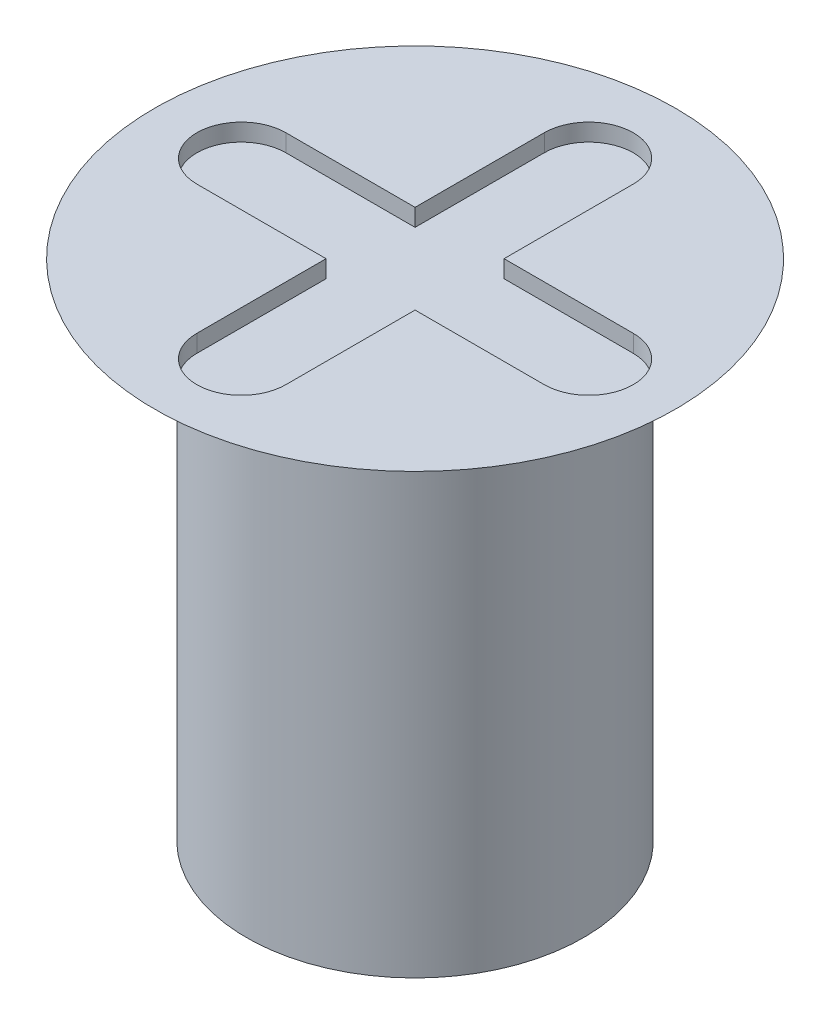
ISO-10303-21;
HEADER;
FILE_DESCRIPTION(('STEP AP214'),'2;1');
FILE_NAME('part.step','',(''),(''),'','','');
FILE_SCHEMA(('AUTOMOTIVE_DESIGN { 1 0 10303 214 1 1 1 1 }'));
ENDSEC;
DATA;
#1=APPLICATION_CONTEXT('core data for automotive mechanical design processes');
#2=APPLICATION_PROTOCOL_DEFINITION('international standard','automotive_design',2000,#1);
#3=PRODUCT_CONTEXT('',#1,'mechanical');
#4=PRODUCT('Part','Part','',(#3));
#5=PRODUCT_RELATED_PRODUCT_CATEGORY('part','',(#4));
#6=PRODUCT_DEFINITION_FORMATION('','',#4);
#7=PRODUCT_DEFINITION_CONTEXT('part definition',#1,'design');
#8=PRODUCT_DEFINITION('design','',#6,#7);
#9=PRODUCT_DEFINITION_SHAPE('','',#8);
#10=(LENGTH_UNIT() NAMED_UNIT(*) SI_UNIT(.MILLI.,.METRE.));
#11=(NAMED_UNIT(*) PLANE_ANGLE_UNIT() SI_UNIT($,.RADIAN.));
#12=(NAMED_UNIT(*) SI_UNIT($,.STERADIAN.) SOLID_ANGLE_UNIT());
#13=UNCERTAINTY_MEASURE_WITH_UNIT(LENGTH_MEASURE(1.E-05),#10,'distance_accuracy_value','');
#14=(GEOMETRIC_REPRESENTATION_CONTEXT(3) GLOBAL_UNCERTAINTY_ASSIGNED_CONTEXT((#13)) GLOBAL_UNIT_ASSIGNED_CONTEXT((#10,
#11,#12)) REPRESENTATION_CONTEXT('',''));
#15=CARTESIAN_POINT('',(0.,0.,0.));
#16=DIRECTION('',(0.,0.,1.));
#17=DIRECTION('',(1.,0.,0.));
#18=AXIS2_PLACEMENT_3D('',#15,#16,#17);
#19=CARTESIAN_POINT('',(0.,2.9,0.));
#20=DIRECTION('',(0.,1.,0.));
#21=DIRECTION('',(0.,0.,1.));
#22=AXIS2_PLACEMENT_3D('',#19,#20,#21);
#23=PLANE('',#22);
#24=CARTESIAN_POINT('',(0.,2.9,-1.));
#25=DIRECTION('',(0.,1.,0.));
#26=DIRECTION('',(0.,0.,1.));
#27=AXIS2_PLACEMENT_3D('',#24,#25,#26);
#28=CIRCLE('',#27,0.256120786291816);
#29=CARTESIAN_POINT('',(0.256120786291816,2.9,-1.));
#30=VERTEX_POINT('',#29);
#31=CARTESIAN_POINT('',(-0.256120786291816,2.9,-1.));
#32=VERTEX_POINT('',#31);
#33=EDGE_CURVE('E46',#30,#32,#28,.T.);
#34=ORIENTED_EDGE('',*,*,#33,.F.);
#35=DIRECTION('',(0.,0.,-1.));
#36=VECTOR('',#35,1.);
#37=CARTESIAN_POINT('',(0.256120786291816,2.9,-1.));
#38=LINE('',#37,#36);
#39=CARTESIAN_POINT('',(0.256120786291816,2.9,-0.256120786291816));
#40=VERTEX_POINT('',#39);
#41=EDGE_CURVE('E183',#40,#30,#38,.T.);
#42=ORIENTED_EDGE('',*,*,#41,.F.);
#43=DIRECTION('',(-1.,0.,0.));
#44=VECTOR('',#43,1.);
#45=CARTESIAN_POINT('',(0.256120786291816,2.9,-0.256120786291816));
#46=LINE('',#45,#44);
#47=CARTESIAN_POINT('',(1.,2.9,-0.256120786291815));
#48=VERTEX_POINT('',#47);
#49=EDGE_CURVE('E181',#48,#40,#46,.T.);
#50=ORIENTED_EDGE('',*,*,#49,.F.);
#51=CARTESIAN_POINT('',(1.,2.9,0.));
#52=DIRECTION('',(0.,1.,0.));
#53=DIRECTION('',(0.,0.,1.));
#54=AXIS2_PLACEMENT_3D('',#51,#52,#53);
#55=CIRCLE('',#54,0.256120786291816);
#56=CARTESIAN_POINT('',(1.,2.9,0.256120786291816));
#57=VERTEX_POINT('',#56);
#58=EDGE_CURVE('E130',#57,#48,#55,.T.);
#59=ORIENTED_EDGE('',*,*,#58,.F.);
#60=DIRECTION('',(1.,0.,0.));
#61=VECTOR('',#60,1.);
#62=CARTESIAN_POINT('',(0.256120786291816,2.9,0.256120786291816));
#63=LINE('',#62,#61);
#64=CARTESIAN_POINT('',(0.256120786291816,2.9,0.256120786291816));
#65=VERTEX_POINT('',#64);
#66=EDGE_CURVE('E177',#65,#57,#63,.T.);
#67=ORIENTED_EDGE('',*,*,#66,.F.);
#68=DIRECTION('',(0.,0.,-1.));
#69=VECTOR('',#68,1.);
#70=CARTESIAN_POINT('',(0.256120786291816,2.9,0.256120786291816));
#71=LINE('',#70,#69);
#72=CARTESIAN_POINT('',(0.256120786291816,2.9,1.));
#73=VERTEX_POINT('',#72);
#74=EDGE_CURVE('E174',#73,#65,#71,.T.);
#75=ORIENTED_EDGE('',*,*,#74,.F.);
#76=CARTESIAN_POINT('',(0.,2.9,1.));
#77=DIRECTION('',(0.,1.,0.));
#78=DIRECTION('',(0.,0.,1.));
#79=AXIS2_PLACEMENT_3D('',#76,#77,#78);
#80=CIRCLE('',#79,0.256120786291816);
#81=CARTESIAN_POINT('',(-0.256120786291816,2.9,1.));
#82=VERTEX_POINT('',#81);
#83=EDGE_CURVE('E171',#82,#73,#80,.T.);
#84=ORIENTED_EDGE('',*,*,#83,.F.);
#85=DIRECTION('',(0.,0.,1.));
#86=VECTOR('',#85,1.);
#87=CARTESIAN_POINT('',(-0.256120786291816,2.9,0.256120786291816));
#88=LINE('',#87,#86);
#89=CARTESIAN_POINT('',(-0.256120786291816,2.9,0.256120786291816));
#90=VERTEX_POINT('',#89);
#91=EDGE_CURVE('E168',#90,#82,#88,.T.);
#92=ORIENTED_EDGE('',*,*,#91,.F.);
#93=DIRECTION('',(1.,0.,0.));
#94=VECTOR('',#93,1.);
#95=CARTESIAN_POINT('',(-1.,2.9,0.256120786291816));
#96=LINE('',#95,#94);
#97=CARTESIAN_POINT('',(-1.,2.9,0.256120786291816));
#98=VERTEX_POINT('',#97);
#99=EDGE_CURVE('E165',#98,#90,#96,.T.);
#100=ORIENTED_EDGE('',*,*,#99,.F.);
#101=CARTESIAN_POINT('',(-1.,2.9,0.));
#102=DIRECTION('',(0.,1.,0.));
#103=DIRECTION('',(0.,0.,1.));
#104=AXIS2_PLACEMENT_3D('',#101,#102,#103);
#105=CIRCLE('',#104,0.256120786291816);
#106=CARTESIAN_POINT('',(-1.,2.9,-0.256120786291816));
#107=VERTEX_POINT('',#106);
#108=EDGE_CURVE('E162',#107,#98,#105,.T.);
#109=ORIENTED_EDGE('',*,*,#108,.F.);
#110=DIRECTION('',(-1.,0.,0.));
#111=VECTOR('',#110,1.);
#112=CARTESIAN_POINT('',(-1.,2.9,-0.256120786291816));
#113=LINE('',#112,#111);
#114=CARTESIAN_POINT('',(-0.256120786291816,2.9,-0.256120786291816));
#115=VERTEX_POINT('',#114);
#116=EDGE_CURVE('E159',#115,#107,#113,.T.);
#117=ORIENTED_EDGE('',*,*,#116,.F.);
#118=DIRECTION('',(0.,0.,1.));
#119=VECTOR('',#118,1.);
#120=CARTESIAN_POINT('',(-0.256120786291816,2.9,-1.));
#121=LINE('',#120,#119);
#122=EDGE_CURVE('E156',#32,#115,#121,.T.);
#123=ORIENTED_EDGE('',*,*,#122,.F.);
#124=EDGE_LOOP('',(#34,#42,#50,#59,#67,#75,#84,#92,#100,#109,#117,#123));
#125=FACE_BOUND('',#124,.T.);
#126=CARTESIAN_POINT('',(0.,2.9,0.));
#127=DIRECTION('',(0.,-1.,0.));
#128=DIRECTION('',(0.,0.,-1.));
#129=AXIS2_PLACEMENT_3D('',#126,#127,#128);
#130=CIRCLE('',#129,1.5);
#131=CARTESIAN_POINT('',(0.,2.9,-1.5));
#132=VERTEX_POINT('',#131);
#133=EDGE_CURVE('E11',#132,#132,#130,.T.);
#134=ORIENTED_EDGE('',*,*,#133,.F.);
#135=EDGE_LOOP('',(#134));
#136=FACE_BOUND('',#135,.T.);
#137=ADVANCED_FACE('F32',(#125,#136),#23,.T.);
#138=CARTESIAN_POINT('',(0.,2.59400435732949,0.));
#139=DIRECTION('',(0.,1.,0.));
#140=DIRECTION('',(0.,0.,1.));
#141=AXIS2_PLACEMENT_3D('',#138,#139,#140);
#142=CONICAL_SURFACE('',#141,0.97,1.04719755119659);
#143=ORIENTED_EDGE('',*,*,#133,.T.);
#144=EDGE_LOOP('',(#143));
#145=FACE_BOUND('',#144,.T.);
#146=CARTESIAN_POINT('',(0.,2.59400435732949,0.));
#147=DIRECTION('',(0.,-1.,0.));
#148=DIRECTION('',(0.,0.,-1.));
#149=AXIS2_PLACEMENT_3D('',#146,#147,#148);
#150=CIRCLE('',#149,0.97);
#151=CARTESIAN_POINT('',(0.,2.59400435732949,-0.97));
#152=VERTEX_POINT('',#151);
#153=EDGE_CURVE('E39',#152,#152,#150,.T.);
#154=ORIENTED_EDGE('',*,*,#153,.F.);
#155=EDGE_LOOP('',(#154));
#156=FACE_BOUND('',#155,.T.);
#157=ADVANCED_FACE('F212',(#145,#156),#142,.T.);
#158=CARTESIAN_POINT('',(0.,0.,0.));
#159=DIRECTION('',(0.,-1.,0.));
#160=DIRECTION('',(0.,0.,-1.));
#161=AXIS2_PLACEMENT_3D('',#158,#159,#160);
#162=CYLINDRICAL_SURFACE('',#161,0.97);
#163=ORIENTED_EDGE('',*,*,#153,.T.);
#164=EDGE_LOOP('',(#163));
#165=FACE_BOUND('',#164,.T.);
#166=CARTESIAN_POINT('',(0.,0.,0.));
#167=DIRECTION('',(0.,-1.,0.));
#168=DIRECTION('',(0.,0.,-1.));
#169=AXIS2_PLACEMENT_3D('',#166,#167,#168);
#170=CIRCLE('',#169,0.97);
#171=CARTESIAN_POINT('',(0.,0.,-0.97));
#172=VERTEX_POINT('',#171);
#173=EDGE_CURVE('E187',#172,#172,#170,.T.);
#174=ORIENTED_EDGE('',*,*,#173,.F.);
#175=EDGE_LOOP('',(#174));
#176=FACE_BOUND('',#175,.T.);
#177=ADVANCED_FACE('F209',(#165,#176),#162,.T.);
#178=CARTESIAN_POINT('',(0.97,0.,0.));
#179=DIRECTION('',(0.,-1.,0.));
#180=DIRECTION('',(0.,0.,-1.));
#181=AXIS2_PLACEMENT_3D('',#178,#179,#180);
#182=PLANE('',#181);
#183=ORIENTED_EDGE('',*,*,#173,.T.);
#184=EDGE_LOOP('',(#183));
#185=FACE_BOUND('',#184,.T.);
#186=ADVANCED_FACE('F219',(#185),#182,.T.);
#187=CARTESIAN_POINT('',(0.,2.8,-1.));
#188=DIRECTION('',(0.,1.,0.));
#189=DIRECTION('',(0.,0.,1.));
#190=AXIS2_PLACEMENT_3D('',#187,#188,#189);
#191=CYLINDRICAL_SURFACE('',#190,0.256120786291816);
#192=ORIENTED_EDGE('',*,*,#33,.T.);
#193=DIRECTION('',(0.,1.,0.));
#194=VECTOR('',#193,1.);
#195=CARTESIAN_POINT('',(-0.256120786291816,2.8,-1.));
#196=LINE('',#195,#194);
#197=CARTESIAN_POINT('',(-0.256120786291816,2.8,-1.));
#198=VERTEX_POINT('',#197);
#199=EDGE_CURVE('E94',#198,#32,#196,.T.);
#200=ORIENTED_EDGE('',*,*,#199,.F.);
#201=CARTESIAN_POINT('',(0.,2.8,-1.));
#202=DIRECTION('',(0.,1.,0.));
#203=DIRECTION('',(0.,0.,1.));
#204=AXIS2_PLACEMENT_3D('',#201,#202,#203);
#205=CIRCLE('',#204,0.256120786291816);
#206=CARTESIAN_POINT('',(0.256120786291816,2.8,-1.));
#207=VERTEX_POINT('',#206);
#208=EDGE_CURVE('E185',#207,#198,#205,.T.);
#209=ORIENTED_EDGE('',*,*,#208,.F.);
#210=DIRECTION('',(0.,1.,0.));
#211=VECTOR('',#210,1.);
#212=CARTESIAN_POINT('',(0.256120786291816,2.8,-1.));
#213=LINE('',#212,#211);
#214=EDGE_CURVE('E54',#207,#30,#213,.T.);
#215=ORIENTED_EDGE('',*,*,#214,.T.);
#216=EDGE_LOOP('',(#192,#200,#209,#215));
#217=FACE_BOUND('',#216,.T.);
#218=ADVANCED_FACE('F225',(#217),#191,.F.);
#219=CARTESIAN_POINT('',(0.256120786291816,2.8,-1.));
#220=DIRECTION('',(1.,0.,0.));
#221=DIRECTION('',(0.,0.,-1.));
#222=AXIS2_PLACEMENT_3D('',#219,#220,#221);
#223=PLANE('',#222);
#224=ORIENTED_EDGE('',*,*,#41,.T.);
#225=ORIENTED_EDGE('',*,*,#214,.F.);
#226=DIRECTION('',(0.,0.,-1.));
#227=VECTOR('',#226,1.);
#228=CARTESIAN_POINT('',(0.256120786291816,2.8,-1.));
#229=LINE('',#228,#227);
#230=CARTESIAN_POINT('',(0.256120786291816,2.8,-0.256120786291816));
#231=VERTEX_POINT('',#230);
#232=EDGE_CURVE('E142',#231,#207,#229,.T.);
#233=ORIENTED_EDGE('',*,*,#232,.F.);
#234=DIRECTION('',(0.,1.,0.));
#235=VECTOR('',#234,1.);
#236=CARTESIAN_POINT('',(0.256120786291816,2.8,-0.256120786291816));
#237=LINE('',#236,#235);
#238=EDGE_CURVE('E134',#231,#40,#237,.T.);
#239=ORIENTED_EDGE('',*,*,#238,.T.);
#240=EDGE_LOOP('',(#224,#225,#233,#239));
#241=FACE_BOUND('',#240,.T.);
#242=ADVANCED_FACE('F229',(#241),#223,.F.);
#243=CARTESIAN_POINT('',(0.256120786291816,2.8,-0.256120786291816));
#244=DIRECTION('',(0.,0.,-1.));
#245=DIRECTION('',(-1.,0.,0.));
#246=AXIS2_PLACEMENT_3D('',#243,#244,#245);
#247=PLANE('',#246);
#248=ORIENTED_EDGE('',*,*,#49,.T.);
#249=ORIENTED_EDGE('',*,*,#238,.F.);
#250=DIRECTION('',(-1.,0.,0.));
#251=VECTOR('',#250,1.);
#252=CARTESIAN_POINT('',(0.256120786291816,2.8,-0.256120786291816));
#253=LINE('',#252,#251);
#254=CARTESIAN_POINT('',(1.,2.8,-0.256120786291815));
#255=VERTEX_POINT('',#254);
#256=EDGE_CURVE('E138',#255,#231,#253,.T.);
#257=ORIENTED_EDGE('',*,*,#256,.F.);
#258=DIRECTION('',(0.,1.,0.));
#259=VECTOR('',#258,1.);
#260=CARTESIAN_POINT('',(1.,2.8,-0.256120786291815));
#261=LINE('',#260,#259);
#262=EDGE_CURVE('E123',#255,#48,#261,.T.);
#263=ORIENTED_EDGE('',*,*,#262,.T.);
#264=EDGE_LOOP('',(#248,#249,#257,#263));
#265=FACE_BOUND('',#264,.T.);
#266=ADVANCED_FACE('F139',(#265),#247,.F.);
#267=CARTESIAN_POINT('',(1.,2.8,0.));
#268=DIRECTION('',(0.,1.,0.));
#269=DIRECTION('',(0.,0.,1.));
#270=AXIS2_PLACEMENT_3D('',#267,#268,#269);
#271=CYLINDRICAL_SURFACE('',#270,0.256120786291816);
#272=ORIENTED_EDGE('',*,*,#58,.T.);
#273=ORIENTED_EDGE('',*,*,#262,.F.);
#274=CARTESIAN_POINT('',(1.,2.8,0.));
#275=DIRECTION('',(0.,1.,0.));
#276=DIRECTION('',(0.,0.,1.));
#277=AXIS2_PLACEMENT_3D('',#274,#275,#276);
#278=CIRCLE('',#277,0.256120786291816);
#279=CARTESIAN_POINT('',(1.,2.8,0.256120786291816));
#280=VERTEX_POINT('',#279);
#281=EDGE_CURVE('E127',#280,#255,#278,.T.);
#282=ORIENTED_EDGE('',*,*,#281,.F.);
#283=DIRECTION('',(0.,1.,0.));
#284=VECTOR('',#283,1.);
#285=CARTESIAN_POINT('',(1.,2.8,0.256120786291816));
#286=LINE('',#285,#284);
#287=EDGE_CURVE('E135',#280,#57,#286,.T.);
#288=ORIENTED_EDGE('',*,*,#287,.T.);
#289=EDGE_LOOP('',(#272,#273,#282,#288));
#290=FACE_BOUND('',#289,.T.);
#291=ADVANCED_FACE('F125',(#290),#271,.F.);
#292=CARTESIAN_POINT('',(0.256120786291816,2.8,0.256120786291816));
#293=DIRECTION('',(0.,0.,1.));
#294=DIRECTION('',(1.,0.,0.));
#295=AXIS2_PLACEMENT_3D('',#292,#293,#294);
#296=PLANE('',#295);
#297=ORIENTED_EDGE('',*,*,#66,.T.);
#298=ORIENTED_EDGE('',*,*,#287,.F.);
#299=DIRECTION('',(1.,0.,0.));
#300=VECTOR('',#299,1.);
#301=CARTESIAN_POINT('',(0.256120786291816,2.8,0.256120786291816));
#302=LINE('',#301,#300);
#303=CARTESIAN_POINT('',(0.256120786291816,2.8,0.256120786291816));
#304=VERTEX_POINT('',#303);
#305=EDGE_CURVE('E148',#304,#280,#302,.T.);
#306=ORIENTED_EDGE('',*,*,#305,.F.);
#307=DIRECTION('',(0.,1.,0.));
#308=VECTOR('',#307,1.);
#309=CARTESIAN_POINT('',(0.256120786291816,2.8,0.256120786291816));
#310=LINE('',#309,#308);
#311=EDGE_CURVE('E190',#304,#65,#310,.T.);
#312=ORIENTED_EDGE('',*,*,#311,.T.);
#313=EDGE_LOOP('',(#297,#298,#306,#312));
#314=FACE_BOUND('',#313,.T.);
#315=ADVANCED_FACE('F257',(#314),#296,.F.);
#316=CARTESIAN_POINT('',(0.256120786291816,2.8,0.256120786291816));
#317=DIRECTION('',(1.,0.,0.));
#318=DIRECTION('',(0.,0.,-1.));
#319=AXIS2_PLACEMENT_3D('',#316,#317,#318);
#320=PLANE('',#319);
#321=ORIENTED_EDGE('',*,*,#74,.T.);
#322=ORIENTED_EDGE('',*,*,#311,.F.);
#323=DIRECTION('',(0.,0.,-1.));
#324=VECTOR('',#323,1.);
#325=CARTESIAN_POINT('',(0.256120786291816,2.8,0.256120786291816));
#326=LINE('',#325,#324);
#327=CARTESIAN_POINT('',(0.256120786291816,2.8,1.));
#328=VERTEX_POINT('',#327);
#329=EDGE_CURVE('E150',#328,#304,#326,.T.);
#330=ORIENTED_EDGE('',*,*,#329,.F.);
#331=DIRECTION('',(0.,1.,0.));
#332=VECTOR('',#331,1.);
#333=CARTESIAN_POINT('',(0.256120786291816,2.8,1.));
#334=LINE('',#333,#332);
#335=EDGE_CURVE('E192',#328,#73,#334,.T.);
#336=ORIENTED_EDGE('',*,*,#335,.T.);
#337=EDGE_LOOP('',(#321,#322,#330,#336));
#338=FACE_BOUND('',#337,.T.);
#339=ADVANCED_FACE('F253',(#338),#320,.F.);
#340=CARTESIAN_POINT('',(0.,2.8,1.));
#341=DIRECTION('',(0.,1.,0.));
#342=DIRECTION('',(0.,0.,1.));
#343=AXIS2_PLACEMENT_3D('',#340,#341,#342);
#344=CYLINDRICAL_SURFACE('',#343,0.256120786291816);
#345=ORIENTED_EDGE('',*,*,#83,.T.);
#346=ORIENTED_EDGE('',*,*,#335,.F.);
#347=CARTESIAN_POINT('',(0.,2.8,1.));
#348=DIRECTION('',(0.,1.,0.));
#349=DIRECTION('',(0.,0.,1.));
#350=AXIS2_PLACEMENT_3D('',#347,#348,#349);
#351=CIRCLE('',#350,0.256120786291816);
#352=CARTESIAN_POINT('',(-0.256120786291816,2.8,1.));
#353=VERTEX_POINT('',#352);
#354=EDGE_CURVE('E392',#353,#328,#351,.T.);
#355=ORIENTED_EDGE('',*,*,#354,.F.);
#356=DIRECTION('',(0.,1.,0.));
#357=VECTOR('',#356,1.);
#358=CARTESIAN_POINT('',(-0.256120786291816,2.8,1.));
#359=LINE('',#358,#357);
#360=EDGE_CURVE('E194',#353,#82,#359,.T.);
#361=ORIENTED_EDGE('',*,*,#360,.T.);
#362=EDGE_LOOP('',(#345,#346,#355,#361));
#363=FACE_BOUND('',#362,.T.);
#364=ADVANCED_FACE('F249',(#363),#344,.F.);
#365=CARTESIAN_POINT('',(-0.256120786291816,2.8,0.256120786291816));
#366=DIRECTION('',(-1.,0.,0.));
#367=DIRECTION('',(0.,0.,1.));
#368=AXIS2_PLACEMENT_3D('',#365,#366,#367);
#369=PLANE('',#368);
#370=ORIENTED_EDGE('',*,*,#91,.T.);
#371=ORIENTED_EDGE('',*,*,#360,.F.);
#372=DIRECTION('',(0.,0.,1.));
#373=VECTOR('',#372,1.);
#374=CARTESIAN_POINT('',(-0.256120786291816,2.8,0.256120786291816));
#375=LINE('',#374,#373);
#376=CARTESIAN_POINT('',(-0.256120786291816,2.8,0.256120786291816));
#377=VERTEX_POINT('',#376);
#378=EDGE_CURVE('E389',#377,#353,#375,.T.);
#379=ORIENTED_EDGE('',*,*,#378,.F.);
#380=DIRECTION('',(0.,1.,0.));
#381=VECTOR('',#380,1.);
#382=CARTESIAN_POINT('',(-0.256120786291816,2.8,0.256120786291816));
#383=LINE('',#382,#381);
#384=EDGE_CURVE('E196',#377,#90,#383,.T.);
#385=ORIENTED_EDGE('',*,*,#384,.T.);
#386=EDGE_LOOP('',(#370,#371,#379,#385));
#387=FACE_BOUND('',#386,.T.);
#388=ADVANCED_FACE('F245',(#387),#369,.F.);
#389=CARTESIAN_POINT('',(-1.,2.8,0.256120786291816));
#390=DIRECTION('',(0.,0.,1.));
#391=DIRECTION('',(1.,0.,0.));
#392=AXIS2_PLACEMENT_3D('',#389,#390,#391);
#393=PLANE('',#392);
#394=ORIENTED_EDGE('',*,*,#99,.T.);
#395=ORIENTED_EDGE('',*,*,#384,.F.);
#396=DIRECTION('',(1.,0.,0.));
#397=VECTOR('',#396,1.);
#398=CARTESIAN_POINT('',(-1.,2.8,0.256120786291816));
#399=LINE('',#398,#397);
#400=CARTESIAN_POINT('',(-1.,2.8,0.256120786291816));
#401=VERTEX_POINT('',#400);
#402=EDGE_CURVE('E386',#401,#377,#399,.T.);
#403=ORIENTED_EDGE('',*,*,#402,.F.);
#404=DIRECTION('',(0.,1.,0.));
#405=VECTOR('',#404,1.);
#406=CARTESIAN_POINT('',(-1.,2.8,0.256120786291816));
#407=LINE('',#406,#405);
#408=EDGE_CURVE('E198',#401,#98,#407,.T.);
#409=ORIENTED_EDGE('',*,*,#408,.T.);
#410=EDGE_LOOP('',(#394,#395,#403,#409));
#411=FACE_BOUND('',#410,.T.);
#412=ADVANCED_FACE('F241',(#411),#393,.F.);
#413=CARTESIAN_POINT('',(-1.,2.8,0.));
#414=DIRECTION('',(0.,1.,0.));
#415=DIRECTION('',(0.,0.,1.));
#416=AXIS2_PLACEMENT_3D('',#413,#414,#415);
#417=CYLINDRICAL_SURFACE('',#416,0.256120786291816);
#418=ORIENTED_EDGE('',*,*,#108,.T.);
#419=ORIENTED_EDGE('',*,*,#408,.F.);
#420=CARTESIAN_POINT('',(-1.,2.8,0.));
#421=DIRECTION('',(0.,1.,0.));
#422=DIRECTION('',(0.,0.,1.));
#423=AXIS2_PLACEMENT_3D('',#420,#421,#422);
#424=CIRCLE('',#423,0.256120786291816);
#425=CARTESIAN_POINT('',(-1.,2.8,-0.256120786291816));
#426=VERTEX_POINT('',#425);
#427=EDGE_CURVE('E383',#426,#401,#424,.T.);
#428=ORIENTED_EDGE('',*,*,#427,.F.);
#429=DIRECTION('',(0.,1.,0.));
#430=VECTOR('',#429,1.);
#431=CARTESIAN_POINT('',(-1.,2.8,-0.256120786291816));
#432=LINE('',#431,#430);
#433=EDGE_CURVE('E200',#426,#107,#432,.T.);
#434=ORIENTED_EDGE('',*,*,#433,.T.);
#435=EDGE_LOOP('',(#418,#419,#428,#434));
#436=FACE_BOUND('',#435,.T.);
#437=ADVANCED_FACE('F237',(#436),#417,.F.);
#438=CARTESIAN_POINT('',(-1.,2.8,-0.256120786291816));
#439=DIRECTION('',(0.,0.,-1.));
#440=DIRECTION('',(-1.,0.,0.));
#441=AXIS2_PLACEMENT_3D('',#438,#439,#440);
#442=PLANE('',#441);
#443=ORIENTED_EDGE('',*,*,#116,.T.);
#444=ORIENTED_EDGE('',*,*,#433,.F.);
#445=DIRECTION('',(-1.,0.,0.));
#446=VECTOR('',#445,1.);
#447=CARTESIAN_POINT('',(-1.,2.8,-0.256120786291816));
#448=LINE('',#447,#446);
#449=CARTESIAN_POINT('',(-0.256120786291816,2.8,-0.256120786291816));
#450=VERTEX_POINT('',#449);
#451=EDGE_CURVE('E378',#450,#426,#448,.T.);
#452=ORIENTED_EDGE('',*,*,#451,.F.);
#453=DIRECTION('',(0.,1.,0.));
#454=VECTOR('',#453,1.);
#455=CARTESIAN_POINT('',(-0.256120786291816,2.8,-0.256120786291816));
#456=LINE('',#455,#454);
#457=EDGE_CURVE('E202',#450,#115,#456,.T.);
#458=ORIENTED_EDGE('',*,*,#457,.T.);
#459=EDGE_LOOP('',(#443,#444,#452,#458));
#460=FACE_BOUND('',#459,.T.);
#461=ADVANCED_FACE('F233',(#460),#442,.F.);
#462=CARTESIAN_POINT('',(-0.256120786291816,2.8,-1.));
#463=DIRECTION('',(-1.,0.,0.));
#464=DIRECTION('',(0.,0.,1.));
#465=AXIS2_PLACEMENT_3D('',#462,#463,#464);
#466=PLANE('',#465);
#467=ORIENTED_EDGE('',*,*,#122,.T.);
#468=ORIENTED_EDGE('',*,*,#457,.F.);
#469=DIRECTION('',(0.,0.,1.));
#470=VECTOR('',#469,1.);
#471=CARTESIAN_POINT('',(-0.256120786291816,2.8,-1.));
#472=LINE('',#471,#470);
#473=EDGE_CURVE('E376',#198,#450,#472,.T.);
#474=ORIENTED_EDGE('',*,*,#473,.F.);
#475=ORIENTED_EDGE('',*,*,#199,.T.);
#476=EDGE_LOOP('',(#467,#468,#474,#475));
#477=FACE_BOUND('',#476,.T.);
#478=ADVANCED_FACE('F230',(#477),#466,.F.);
#479=CARTESIAN_POINT('',(0.,2.8,-1.));
#480=DIRECTION('',(0.,1.,0.));
#481=DIRECTION('',(0.,0.,1.));
#482=AXIS2_PLACEMENT_3D('',#479,#480,#481);
#483=PLANE('',#482);
#484=ORIENTED_EDGE('',*,*,#208,.T.);
#485=ORIENTED_EDGE('',*,*,#473,.T.);
#486=ORIENTED_EDGE('',*,*,#451,.T.);
#487=ORIENTED_EDGE('',*,*,#427,.T.);
#488=ORIENTED_EDGE('',*,*,#402,.T.);
#489=ORIENTED_EDGE('',*,*,#378,.T.);
#490=ORIENTED_EDGE('',*,*,#354,.T.);
#491=ORIENTED_EDGE('',*,*,#329,.T.);
#492=ORIENTED_EDGE('',*,*,#305,.T.);
#493=ORIENTED_EDGE('',*,*,#281,.T.);
#494=ORIENTED_EDGE('',*,*,#256,.T.);
#495=ORIENTED_EDGE('',*,*,#232,.T.);
#496=EDGE_LOOP('',(#484,#485,#486,#487,#488,#489,#490,#491,#492,#493,#494,#495));
#497=FACE_BOUND('',#496,.T.);
#498=ADVANCED_FACE('F145',(#497),#483,.T.);
#499=CLOSED_SHELL('',(#137,#157,#177,#186,#218,#242,#266,#291,#315,#339,#364,#388,#412,#437,
#461,#478,#498));
#500=MANIFOLD_SOLID_BREP('B2',#499);
#501=ADVANCED_BREP_SHAPE_REPRESENTATION('',(#18,#500),#14);
#502=SHAPE_DEFINITION_REPRESENTATION(#9,#501);
ENDSEC;
END-ISO-10303-21;
